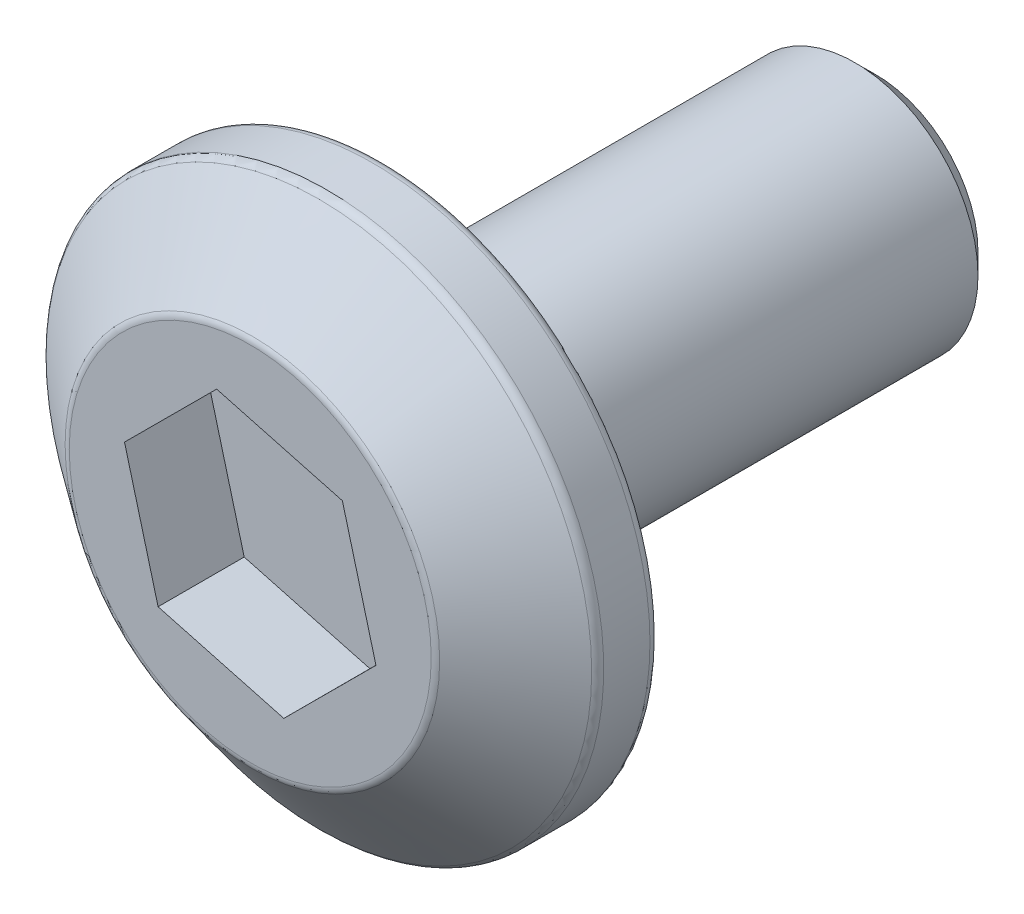
ISO-10303-21;
HEADER;
FILE_DESCRIPTION(('STEP AP214'),'2;1');
FILE_NAME('part.step','',(''),(''),'','','');
FILE_SCHEMA(('AUTOMOTIVE_DESIGN { 1 0 10303 214 1 1 1 1 }'));
ENDSEC;
DATA;
#1=APPLICATION_CONTEXT('core data for automotive mechanical design processes');
#2=APPLICATION_PROTOCOL_DEFINITION('international standard','automotive_design',2000,#1);
#3=PRODUCT_CONTEXT('',#1,'mechanical');
#4=PRODUCT('Part','Part','',(#3));
#5=PRODUCT_RELATED_PRODUCT_CATEGORY('part','',(#4));
#6=PRODUCT_DEFINITION_FORMATION('','',#4);
#7=PRODUCT_DEFINITION_CONTEXT('part definition',#1,'design');
#8=PRODUCT_DEFINITION('design','',#6,#7);
#9=PRODUCT_DEFINITION_SHAPE('','',#8);
#10=(LENGTH_UNIT() NAMED_UNIT(*) SI_UNIT(.MILLI.,.METRE.));
#11=(NAMED_UNIT(*) PLANE_ANGLE_UNIT() SI_UNIT($,.RADIAN.));
#12=(NAMED_UNIT(*) SI_UNIT($,.STERADIAN.) SOLID_ANGLE_UNIT());
#13=UNCERTAINTY_MEASURE_WITH_UNIT(LENGTH_MEASURE(1.E-05),#10,'distance_accuracy_value','');
#14=(GEOMETRIC_REPRESENTATION_CONTEXT(3) GLOBAL_UNCERTAINTY_ASSIGNED_CONTEXT((#13)) GLOBAL_UNIT_ASSIGNED_CONTEXT((#10,
#11,#12)) REPRESENTATION_CONTEXT('',''));
#15=CARTESIAN_POINT('',(0.,0.,0.));
#16=DIRECTION('',(0.,0.,1.));
#17=DIRECTION('',(1.,0.,0.));
#18=AXIS2_PLACEMENT_3D('',#15,#16,#17);
#19=CARTESIAN_POINT('',(0.,0.,12.));
#20=DIRECTION('',(0.,0.,-1.));
#21=DIRECTION('',(-1.,0.,0.));
#22=AXIS2_PLACEMENT_3D('',#19,#20,#21);
#23=CYLINDRICAL_SURFACE('',#22,3.);
#24=CARTESIAN_POINT('',(0.,0.,0.500000000000004));
#25=DIRECTION('',(0.,0.,1.));
#26=DIRECTION('',(1.,0.,0.));
#27=AXIS2_PLACEMENT_3D('',#24,#25,#26);
#28=CIRCLE('',#27,3.);
#29=CARTESIAN_POINT('',(3.,0.,0.500000000000004));
#30=VERTEX_POINT('',#29);
#31=EDGE_CURVE('E52',#30,#30,#28,.T.);
#32=ORIENTED_EDGE('',*,*,#31,.T.);
#33=EDGE_LOOP('',(#32));
#34=FACE_BOUND('',#33,.T.);
#35=CARTESIAN_POINT('',(0.,0.,12.));
#36=DIRECTION('',(0.,0.,1.));
#37=DIRECTION('',(1.,0.,0.));
#38=AXIS2_PLACEMENT_3D('',#35,#36,#37);
#39=CIRCLE('',#38,3.);
#40=CARTESIAN_POINT('',(3.,0.,12.));
#41=VERTEX_POINT('',#40);
#42=EDGE_CURVE('E158',#41,#41,#39,.T.);
#43=ORIENTED_EDGE('',*,*,#42,.F.);
#44=EDGE_LOOP('',(#43));
#45=FACE_BOUND('',#44,.T.);
#46=ADVANCED_FACE('F43',(#34,#45),#23,.T.);
#47=CARTESIAN_POINT('',(0.,0.,0.));
#48=DIRECTION('',(0.,0.,1.));
#49=DIRECTION('',(1.,0.,0.));
#50=AXIS2_PLACEMENT_3D('',#47,#48,#49);
#51=PLANE('',#50);
#52=CARTESIAN_POINT('',(0.,0.,0.));
#53=DIRECTION('',(0.,0.,1.));
#54=DIRECTION('',(1.,0.,0.));
#55=AXIS2_PLACEMENT_3D('',#52,#53,#54);
#56=CIRCLE('',#55,2.5);
#57=CARTESIAN_POINT('',(2.5,0.,0.));
#58=VERTEX_POINT('',#57);
#59=EDGE_CURVE('E12',#58,#58,#56,.F.);
#60=ORIENTED_EDGE('',*,*,#59,.T.);
#61=EDGE_LOOP('',(#60));
#62=FACE_BOUND('',#61,.T.);
#63=ADVANCED_FACE('F209',(#62),#51,.F.);
#64=CARTESIAN_POINT('',(0.,0.,12.));
#65=DIRECTION('',(0.,0.,1.));
#66=DIRECTION('',(1.,0.,0.));
#67=AXIS2_PLACEMENT_3D('',#64,#65,#66);
#68=PLANE('',#67);
#69=CARTESIAN_POINT('',(0.,0.,12.));
#70=DIRECTION('',(0.,0.,1.));
#71=DIRECTION('',(1.,0.,0.));
#72=AXIS2_PLACEMENT_3D('',#69,#70,#71);
#73=CIRCLE('',#72,6.5);
#74=CARTESIAN_POINT('',(6.5,0.,12.));
#75=VERTEX_POINT('',#74);
#76=EDGE_CURVE('E191',#75,#75,#73,.F.);
#77=ORIENTED_EDGE('',*,*,#76,.T.);
#78=EDGE_LOOP('',(#77));
#79=FACE_BOUND('',#78,.T.);
#80=ORIENTED_EDGE('',*,*,#42,.T.);
#81=EDGE_LOOP('',(#80));
#82=FACE_BOUND('',#81,.T.);
#83=ADVANCED_FACE('F214',(#79,#82),#68,.F.);
#84=CARTESIAN_POINT('',(0.,0.,13.5));
#85=DIRECTION('',(0.,0.,-1.));
#86=DIRECTION('',(-1.,0.,0.));
#87=AXIS2_PLACEMENT_3D('',#84,#85,#86);
#88=CYLINDRICAL_SURFACE('',#87,6.75);
#89=CARTESIAN_POINT('',(0.,0.,13.3777290485836));
#90=DIRECTION('',(0.,0.,-1.));
#91=DIRECTION('',(-1.,0.,0.));
#92=AXIS2_PLACEMENT_3D('',#89,#90,#91);
#93=CIRCLE('',#92,6.75);
#94=CARTESIAN_POINT('',(-6.75,0.,13.3777290485836));
#95=VERTEX_POINT('',#94);
#96=EDGE_CURVE('E187',#95,#95,#93,.T.);
#97=ORIENTED_EDGE('',*,*,#96,.T.);
#98=EDGE_LOOP('',(#97));
#99=FACE_BOUND('',#98,.T.);
#100=CARTESIAN_POINT('',(0.,0.,12.25));
#101=DIRECTION('',(0.,0.,1.));
#102=DIRECTION('',(1.,0.,0.));
#103=AXIS2_PLACEMENT_3D('',#100,#101,#102);
#104=CIRCLE('',#103,6.75);
#105=CARTESIAN_POINT('',(6.75,0.,12.25));
#106=VERTEX_POINT('',#105);
#107=EDGE_CURVE('E183',#106,#106,#104,.T.);
#108=ORIENTED_EDGE('',*,*,#107,.T.);
#109=EDGE_LOOP('',(#108));
#110=FACE_BOUND('',#109,.T.);
#111=ADVANCED_FACE('F240',(#99,#110),#88,.T.);
#112=CARTESIAN_POINT('',(0.,0.,15.25));
#113=DIRECTION('',(0.,0.,1.));
#114=DIRECTION('',(1.,0.,0.));
#115=AXIS2_PLACEMENT_3D('',#112,#113,#114);
#116=PLANE('',#115);
#117=DIRECTION('',(0.707743241263761,0.706469747721348,0.));
#118=VECTOR('',#117,1.);
#119=CARTESIAN_POINT('',(0.819098491366586,-3.06796528578377,15.25));
#120=LINE('',#119,#118);
#121=CARTESIAN_POINT('',(0.819098491366586,-3.06796528578377,15.25));
#122=VERTEX_POINT('',#121);
#123=CARTESIAN_POINT('',(3.06648512110083,-0.824622541166914,15.25));
#124=VERTEX_POINT('',#123);
#125=EDGE_CURVE('E59',#122,#124,#120,.T.);
#126=ORIENTED_EDGE('',*,*,#125,.F.);
#127=DIRECTION('',(0.965692369163752,-0.259688752430483,0.));
#128=VECTOR('',#127,1.);
#129=CARTESIAN_POINT('',(-2.24738662973424,-2.24334274461686,15.25));
#130=LINE('',#129,#128);
#131=CARTESIAN_POINT('',(-2.24738662973424,-2.24334274461686,15.25));
#132=VERTEX_POINT('',#131);
#133=EDGE_CURVE('E152',#132,#122,#130,.T.);
#134=ORIENTED_EDGE('',*,*,#133,.F.);
#135=DIRECTION('',(0.25794912789999,-0.966158500151831,0.));
#136=VECTOR('',#135,1.);
#137=CARTESIAN_POINT('',(-3.06648512110083,0.824622541166915,15.25));
#138=LINE('',#137,#136);
#139=CARTESIAN_POINT('',(-3.06648512110083,0.824622541166915,15.25));
#140=VERTEX_POINT('',#139);
#141=EDGE_CURVE('E149',#140,#132,#138,.T.);
#142=ORIENTED_EDGE('',*,*,#141,.F.);
#143=DIRECTION('',(-0.707743241263762,-0.706469747721348,0.));
#144=VECTOR('',#143,1.);
#145=CARTESIAN_POINT('',(-0.819098491366586,3.06796528578377,15.25));
#146=LINE('',#145,#144);
#147=CARTESIAN_POINT('',(-0.819098491366586,3.06796528578377,15.25));
#148=VERTEX_POINT('',#147);
#149=EDGE_CURVE('E107',#148,#140,#146,.T.);
#150=ORIENTED_EDGE('',*,*,#149,.F.);
#151=DIRECTION('',(-0.965692369163752,0.259688752430483,0.));
#152=VECTOR('',#151,1.);
#153=CARTESIAN_POINT('',(2.24738662973424,2.24334274461686,15.25));
#154=LINE('',#153,#152);
#155=CARTESIAN_POINT('',(2.24738662973424,2.24334274461686,15.25));
#156=VERTEX_POINT('',#155);
#157=EDGE_CURVE('E143',#156,#148,#154,.T.);
#158=ORIENTED_EDGE('',*,*,#157,.F.);
#159=DIRECTION('',(-0.25794912789999,0.96615850015183,0.));
#160=VECTOR('',#159,1.);
#161=CARTESIAN_POINT('',(3.06648512110083,-0.824622541166913,15.25));
#162=LINE('',#161,#160);
#163=EDGE_CURVE('E139',#124,#156,#162,.T.);
#164=ORIENTED_EDGE('',*,*,#163,.F.);
#165=EDGE_LOOP('',(#126,#134,#142,#150,#158,#164));
#166=FACE_BOUND('',#165,.T.);
#167=CARTESIAN_POINT('',(0.,0.,15.25));
#168=DIRECTION('',(0.,0.,1.));
#169=DIRECTION('',(1.,0.,0.));
#170=AXIS2_PLACEMENT_3D('',#167,#168,#169);
#171=CIRCLE('',#170,4.41422306246459);
#172=CARTESIAN_POINT('',(4.41422306246459,0.,15.25));
#173=VERTEX_POINT('',#172);
#174=EDGE_CURVE('E171',#173,#173,#171,.T.);
#175=ORIENTED_EDGE('',*,*,#174,.T.);
#176=EDGE_LOOP('',(#175));
#177=FACE_BOUND('',#176,.T.);
#178=ADVANCED_FACE('F242',(#166,#177),#116,.T.);
#179=CARTESIAN_POINT('',(0.,0.,15.25));
#180=DIRECTION('',(0.,0.,-1.));
#181=DIRECTION('',(-1.,0.,0.));
#182=AXIS2_PLACEMENT_3D('',#179,#180,#181);
#183=CONICAL_SURFACE('',#182,4.5,0.90975315794421);
#184=CARTESIAN_POINT('',(0.,0.,15.1973380543441));
#185=DIRECTION('',(0.,0.,1.));
#186=DIRECTION('',(1.,0.,0.));
#187=AXIS2_PLACEMENT_3D('',#184,#185,#186);
#188=CIRCLE('',#187,4.56770821584332);
#189=CARTESIAN_POINT('',(4.56770821584332,0.,15.1973380543441));
#190=VERTEX_POINT('',#189);
#191=EDGE_CURVE('E179',#190,#190,#188,.F.);
#192=ORIENTED_EDGE('',*,*,#191,.T.);
#193=EDGE_LOOP('',(#192));
#194=FACE_BOUND('',#193,.T.);
#195=CARTESIAN_POINT('',(0.,0.,13.5750671029277));
#196=DIRECTION('',(0.,0.,-1.));
#197=DIRECTION('',(-1.,0.,0.));
#198=AXIS2_PLACEMENT_3D('',#195,#196,#197);
#199=CIRCLE('',#198,6.65348515337873);
#200=CARTESIAN_POINT('',(-6.65348515337873,0.,13.5750671029277));
#201=VERTEX_POINT('',#200);
#202=EDGE_CURVE('E175',#201,#201,#199,.F.);
#203=ORIENTED_EDGE('',*,*,#202,.T.);
#204=EDGE_LOOP('',(#203));
#205=FACE_BOUND('',#204,.T.);
#206=ADVANCED_FACE('F223',(#194,#205),#183,.T.);
#207=CARTESIAN_POINT('',(0.,0.,15.));
#208=DIRECTION('',(0.,0.,1.));
#209=DIRECTION('',(1.,0.,0.));
#210=AXIS2_PLACEMENT_3D('',#207,#208,#209);
#211=TOROIDAL_SURFACE('',#210,4.41422306246459,0.25);
#212=ORIENTED_EDGE('',*,*,#191,.F.);
#213=EDGE_LOOP('',(#212));
#214=FACE_BOUND('',#213,.T.);
#215=ORIENTED_EDGE('',*,*,#174,.F.);
#216=EDGE_LOOP('',(#215));
#217=FACE_BOUND('',#216,.T.);
#218=ADVANCED_FACE('F219',(#214,#217),#211,.T.);
#219=CARTESIAN_POINT('',(0.,0.,13.3777290485836));
#220=DIRECTION('',(0.,0.,-1.));
#221=DIRECTION('',(-1.,0.,0.));
#222=AXIS2_PLACEMENT_3D('',#219,#220,#221);
#223=TOROIDAL_SURFACE('',#222,6.5,0.25);
#224=ORIENTED_EDGE('',*,*,#96,.F.);
#225=EDGE_LOOP('',(#224));
#226=FACE_BOUND('',#225,.T.);
#227=ORIENTED_EDGE('',*,*,#202,.F.);
#228=EDGE_LOOP('',(#227));
#229=FACE_BOUND('',#228,.T.);
#230=ADVANCED_FACE('F222',(#226,#229),#223,.T.);
#231=CARTESIAN_POINT('',(0.,0.,12.25));
#232=DIRECTION('',(0.,0.,1.));
#233=DIRECTION('',(1.,0.,0.));
#234=AXIS2_PLACEMENT_3D('',#231,#232,#233);
#235=TOROIDAL_SURFACE('',#234,6.5,0.25);
#236=ORIENTED_EDGE('',*,*,#76,.F.);
#237=EDGE_LOOP('',(#236));
#238=FACE_BOUND('',#237,.T.);
#239=ORIENTED_EDGE('',*,*,#107,.F.);
#240=EDGE_LOOP('',(#239));
#241=FACE_BOUND('',#240,.T.);
#242=ADVANCED_FACE('F226',(#238,#241),#235,.T.);
#243=CARTESIAN_POINT('',(0.819098491366586,-3.06796528578377,13.15));
#244=DIRECTION('',(0.706469747721348,-0.707743241263762,0.));
#245=DIRECTION('',(0.707743241263762,0.706469747721348,0.));
#246=AXIS2_PLACEMENT_3D('',#243,#244,#245);
#247=PLANE('',#246);
#248=ORIENTED_EDGE('',*,*,#125,.T.);
#249=DIRECTION('',(0.,0.,1.));
#250=VECTOR('',#249,1.);
#251=CARTESIAN_POINT('',(3.06648512110083,-0.824622541166913,13.15));
#252=LINE('',#251,#250);
#253=CARTESIAN_POINT('',(3.06648512110083,-0.824622541166913,13.15));
#254=VERTEX_POINT('',#253);
#255=EDGE_CURVE('E89',#254,#124,#252,.T.);
#256=ORIENTED_EDGE('',*,*,#255,.F.);
#257=DIRECTION('',(0.707743241263761,0.706469747721348,0.));
#258=VECTOR('',#257,1.);
#259=CARTESIAN_POINT('',(0.819098491366586,-3.06796528578377,13.15));
#260=LINE('',#259,#258);
#261=CARTESIAN_POINT('',(0.819098491366586,-3.06796528578377,13.15));
#262=VERTEX_POINT('',#261);
#263=EDGE_CURVE('E155',#262,#254,#260,.T.);
#264=ORIENTED_EDGE('',*,*,#263,.F.);
#265=DIRECTION('',(0.,0.,1.));
#266=VECTOR('',#265,1.);
#267=CARTESIAN_POINT('',(0.819098491366586,-3.06796528578377,13.15));
#268=LINE('',#267,#266);
#269=EDGE_CURVE('E67',#262,#122,#268,.T.);
#270=ORIENTED_EDGE('',*,*,#269,.T.);
#271=EDGE_LOOP('',(#248,#256,#264,#270));
#272=FACE_BOUND('',#271,.T.);
#273=ADVANCED_FACE('F229',(#272),#247,.F.);
#274=CARTESIAN_POINT('',(-2.24738662973424,-2.24334274461686,13.15));
#275=DIRECTION('',(-0.259688752430483,-0.965692369163752,0.));
#276=DIRECTION('',(0.965692369163752,-0.259688752430483,0.));
#277=AXIS2_PLACEMENT_3D('',#274,#275,#276);
#278=PLANE('',#277);
#279=ORIENTED_EDGE('',*,*,#133,.T.);
#280=ORIENTED_EDGE('',*,*,#269,.F.);
#281=DIRECTION('',(0.965692369163752,-0.259688752430483,0.));
#282=VECTOR('',#281,1.);
#283=CARTESIAN_POINT('',(-2.24738662973424,-2.24334274461686,13.15));
#284=LINE('',#283,#282);
#285=CARTESIAN_POINT('',(-2.24738662973424,-2.24334274461686,13.15));
#286=VERTEX_POINT('',#285);
#287=EDGE_CURVE('E121',#286,#262,#284,.T.);
#288=ORIENTED_EDGE('',*,*,#287,.F.);
#289=DIRECTION('',(0.,0.,1.));
#290=VECTOR('',#289,1.);
#291=CARTESIAN_POINT('',(-2.24738662973424,-2.24334274461686,13.15));
#292=LINE('',#291,#290);
#293=EDGE_CURVE('E112',#286,#132,#292,.T.);
#294=ORIENTED_EDGE('',*,*,#293,.T.);
#295=EDGE_LOOP('',(#279,#280,#288,#294));
#296=FACE_BOUND('',#295,.T.);
#297=ADVANCED_FACE('F234',(#296),#278,.F.);
#298=CARTESIAN_POINT('',(-3.06648512110083,0.824622541166915,13.15));
#299=DIRECTION('',(-0.96615850015183,-0.25794912789999,0.));
#300=DIRECTION('',(0.25794912789999,-0.96615850015183,0.));
#301=AXIS2_PLACEMENT_3D('',#298,#299,#300);
#302=PLANE('',#301);
#303=ORIENTED_EDGE('',*,*,#141,.T.);
#304=ORIENTED_EDGE('',*,*,#293,.F.);
#305=DIRECTION('',(0.25794912789999,-0.966158500151831,0.));
#306=VECTOR('',#305,1.);
#307=CARTESIAN_POINT('',(-3.06648512110083,0.824622541166915,13.15));
#308=LINE('',#307,#306);
#309=CARTESIAN_POINT('',(-3.06648512110083,0.824622541166915,13.15));
#310=VERTEX_POINT('',#309);
#311=EDGE_CURVE('E116',#310,#286,#308,.T.);
#312=ORIENTED_EDGE('',*,*,#311,.F.);
#313=DIRECTION('',(0.,0.,1.));
#314=VECTOR('',#313,1.);
#315=CARTESIAN_POINT('',(-3.06648512110083,0.824622541166915,13.15));
#316=LINE('',#315,#314);
#317=EDGE_CURVE('E100',#310,#140,#316,.T.);
#318=ORIENTED_EDGE('',*,*,#317,.T.);
#319=EDGE_LOOP('',(#303,#304,#312,#318));
#320=FACE_BOUND('',#319,.T.);
#321=ADVANCED_FACE('F117',(#320),#302,.F.);
#322=CARTESIAN_POINT('',(-0.819098491366586,3.06796528578377,13.15));
#323=DIRECTION('',(-0.706469747721348,0.707743241263762,0.));
#324=DIRECTION('',(-0.707743241263762,-0.706469747721348,0.));
#325=AXIS2_PLACEMENT_3D('',#322,#323,#324);
#326=PLANE('',#325);
#327=ORIENTED_EDGE('',*,*,#149,.T.);
#328=ORIENTED_EDGE('',*,*,#317,.F.);
#329=DIRECTION('',(-0.707743241263762,-0.706469747721348,0.));
#330=VECTOR('',#329,1.);
#331=CARTESIAN_POINT('',(-0.819098491366586,3.06796528578377,13.15));
#332=LINE('',#331,#330);
#333=CARTESIAN_POINT('',(-0.819098491366586,3.06796528578377,13.15));
#334=VERTEX_POINT('',#333);
#335=EDGE_CURVE('E104',#334,#310,#332,.T.);
#336=ORIENTED_EDGE('',*,*,#335,.F.);
#337=DIRECTION('',(0.,0.,1.));
#338=VECTOR('',#337,1.);
#339=CARTESIAN_POINT('',(-0.819098491366586,3.06796528578377,13.15));
#340=LINE('',#339,#338);
#341=EDGE_CURVE('E113',#334,#148,#340,.T.);
#342=ORIENTED_EDGE('',*,*,#341,.T.);
#343=EDGE_LOOP('',(#327,#328,#336,#342));
#344=FACE_BOUND('',#343,.T.);
#345=ADVANCED_FACE('F102',(#344),#326,.F.);
#346=CARTESIAN_POINT('',(2.24738662973424,2.24334274461686,13.15));
#347=DIRECTION('',(0.259688752430483,0.965692369163752,0.));
#348=DIRECTION('',(-0.965692369163752,0.259688752430483,0.));
#349=AXIS2_PLACEMENT_3D('',#346,#347,#348);
#350=PLANE('',#349);
#351=ORIENTED_EDGE('',*,*,#157,.T.);
#352=ORIENTED_EDGE('',*,*,#341,.F.);
#353=DIRECTION('',(-0.965692369163752,0.259688752430483,0.));
#354=VECTOR('',#353,1.);
#355=CARTESIAN_POINT('',(2.24738662973424,2.24334274461686,13.15));
#356=LINE('',#355,#354);
#357=CARTESIAN_POINT('',(2.24738662973424,2.24334274461686,13.15));
#358=VERTEX_POINT('',#357);
#359=EDGE_CURVE('E127',#358,#334,#356,.T.);
#360=ORIENTED_EDGE('',*,*,#359,.F.);
#361=DIRECTION('',(0.,0.,1.));
#362=VECTOR('',#361,1.);
#363=CARTESIAN_POINT('',(2.24738662973424,2.24334274461686,13.15));
#364=LINE('',#363,#362);
#365=EDGE_CURVE('E163',#358,#156,#364,.T.);
#366=ORIENTED_EDGE('',*,*,#365,.T.);
#367=EDGE_LOOP('',(#351,#352,#360,#366));
#368=FACE_BOUND('',#367,.T.);
#369=ADVANCED_FACE('F258',(#368),#350,.F.);
#370=CARTESIAN_POINT('',(3.06648512110083,-0.824622541166913,13.15));
#371=DIRECTION('',(0.96615850015183,0.25794912789999,0.));
#372=DIRECTION('',(-0.25794912789999,0.96615850015183,0.));
#373=AXIS2_PLACEMENT_3D('',#370,#371,#372);
#374=PLANE('',#373);
#375=ORIENTED_EDGE('',*,*,#163,.T.);
#376=ORIENTED_EDGE('',*,*,#365,.F.);
#377=DIRECTION('',(-0.25794912789999,0.96615850015183,0.));
#378=VECTOR('',#377,1.);
#379=CARTESIAN_POINT('',(3.06648512110083,-0.824622541166913,13.15));
#380=LINE('',#379,#378);
#381=EDGE_CURVE('E131',#254,#358,#380,.T.);
#382=ORIENTED_EDGE('',*,*,#381,.F.);
#383=ORIENTED_EDGE('',*,*,#255,.T.);
#384=EDGE_LOOP('',(#375,#376,#382,#383));
#385=FACE_BOUND('',#384,.T.);
#386=ADVANCED_FACE('F205',(#385),#374,.F.);
#387=CARTESIAN_POINT('',(3.06648512110083,-0.824622541166914,13.15));
#388=DIRECTION('',(0.,0.,1.));
#389=DIRECTION('',(1.,0.,0.));
#390=AXIS2_PLACEMENT_3D('',#387,#388,#389);
#391=PLANE('',#390);
#392=ORIENTED_EDGE('',*,*,#263,.T.);
#393=ORIENTED_EDGE('',*,*,#381,.T.);
#394=ORIENTED_EDGE('',*,*,#359,.T.);
#395=ORIENTED_EDGE('',*,*,#335,.T.);
#396=ORIENTED_EDGE('',*,*,#311,.T.);
#397=ORIENTED_EDGE('',*,*,#287,.T.);
#398=EDGE_LOOP('',(#392,#393,#394,#395,#396,#397));
#399=FACE_BOUND('',#398,.T.);
#400=ADVANCED_FACE('F124',(#399),#391,.T.);
#401=CARTESIAN_POINT('',(0.,0.,0.500000000000004));
#402=DIRECTION('',(0.,0.,1.));
#403=DIRECTION('',(1.,0.,0.));
#404=AXIS2_PLACEMENT_3D('',#401,#402,#403);
#405=CONICAL_SURFACE('',#404,3.,0.785398163397449);
#406=ORIENTED_EDGE('',*,*,#59,.F.);
#407=EDGE_LOOP('',(#406));
#408=FACE_BOUND('',#407,.T.);
#409=ORIENTED_EDGE('',*,*,#31,.F.);
#410=EDGE_LOOP('',(#409));
#411=FACE_BOUND('',#410,.T.);
#412=ADVANCED_FACE('F45',(#408,#411),#405,.T.);
#413=CLOSED_SHELL('',(#46,#63,#83,#111,#178,#206,#218,#230,#242,#273,#297,#321,#345,#369,#386,
#400,#412));
#414=MANIFOLD_SOLID_BREP('B2',#413);
#415=ADVANCED_BREP_SHAPE_REPRESENTATION('',(#18,#414),#14);
#416=SHAPE_DEFINITION_REPRESENTATION(#9,#415);
ENDSEC;
END-ISO-10303-21;
